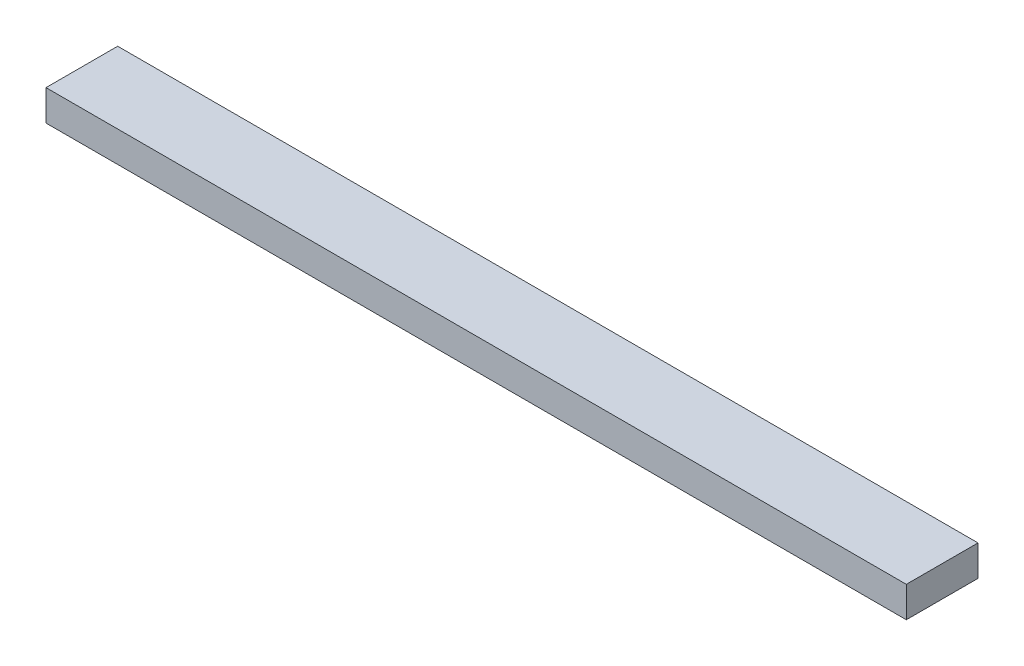
ISO-10303-21;
HEADER;
FILE_DESCRIPTION(('STEP AP214'),'2;1');
FILE_NAME('part.step','',(''),(''),'','','');
FILE_SCHEMA(('AUTOMOTIVE_DESIGN { 1 0 10303 214 1 1 1 1 }'));
ENDSEC;
DATA;
#1=APPLICATION_CONTEXT('core data for automotive mechanical design processes');
#2=APPLICATION_PROTOCOL_DEFINITION('international standard','automotive_design',2000,#1);
#3=PRODUCT_CONTEXT('',#1,'mechanical');
#4=PRODUCT('Part','Part','',(#3));
#5=PRODUCT_RELATED_PRODUCT_CATEGORY('part','',(#4));
#6=PRODUCT_DEFINITION_FORMATION('','',#4);
#7=PRODUCT_DEFINITION_CONTEXT('part definition',#1,'design');
#8=PRODUCT_DEFINITION('design','',#6,#7);
#9=PRODUCT_DEFINITION_SHAPE('','',#8);
#10=(LENGTH_UNIT() NAMED_UNIT(*) SI_UNIT(.MILLI.,.METRE.));
#11=(NAMED_UNIT(*) PLANE_ANGLE_UNIT() SI_UNIT($,.RADIAN.));
#12=(NAMED_UNIT(*) SI_UNIT($,.STERADIAN.) SOLID_ANGLE_UNIT());
#13=UNCERTAINTY_MEASURE_WITH_UNIT(LENGTH_MEASURE(1.E-05),#10,'distance_accuracy_value','');
#14=(GEOMETRIC_REPRESENTATION_CONTEXT(3) GLOBAL_UNCERTAINTY_ASSIGNED_CONTEXT((#13)) GLOBAL_UNIT_ASSIGNED_CONTEXT((#10,
#11,#12)) REPRESENTATION_CONTEXT('',''));
#15=CARTESIAN_POINT('',(0.,0.,0.));
#16=DIRECTION('',(0.,0.,1.));
#17=DIRECTION('',(1.,0.,0.));
#18=AXIS2_PLACEMENT_3D('',#15,#16,#17);
#19=CARTESIAN_POINT('',(0.,38.1,0.));
#20=DIRECTION('',(1.,0.,0.));
#21=DIRECTION('',(0.,0.,-1.));
#22=AXIS2_PLACEMENT_3D('',#19,#20,#21);
#23=PLANE('',#22);
#24=DIRECTION('',(0.,0.,1.));
#25=VECTOR('',#24,1.);
#26=CARTESIAN_POINT('',(0.,0.,0.));
#27=LINE('',#26,#25);
#28=CARTESIAN_POINT('',(0.,0.,-88.9));
#29=VERTEX_POINT('',#28);
#30=CARTESIAN_POINT('',(0.,0.,0.));
#31=VERTEX_POINT('',#30);
#32=EDGE_CURVE('E102',#29,#31,#27,.T.);
#33=ORIENTED_EDGE('',*,*,#32,.T.);
#34=DIRECTION('',(0.,-1.,0.));
#35=VECTOR('',#34,1.);
#36=CARTESIAN_POINT('',(0.,38.1,0.));
#37=LINE('',#36,#35);
#38=CARTESIAN_POINT('',(0.,38.1,0.));
#39=VERTEX_POINT('',#38);
#40=EDGE_CURVE('E11',#39,#31,#37,.T.);
#41=ORIENTED_EDGE('',*,*,#40,.F.);
#42=DIRECTION('',(0.,0.,1.));
#43=VECTOR('',#42,1.);
#44=CARTESIAN_POINT('',(0.,38.1,0.));
#45=LINE('',#44,#43);
#46=CARTESIAN_POINT('',(0.,38.1,-88.9));
#47=VERTEX_POINT('',#46);
#48=EDGE_CURVE('E90',#47,#39,#45,.T.);
#49=ORIENTED_EDGE('',*,*,#48,.F.);
#50=DIRECTION('',(0.,-1.,0.));
#51=VECTOR('',#50,1.);
#52=CARTESIAN_POINT('',(0.,38.1,-88.9));
#53=LINE('',#52,#51);
#54=EDGE_CURVE('E98',#47,#29,#53,.T.);
#55=ORIENTED_EDGE('',*,*,#54,.T.);
#56=EDGE_LOOP('',(#33,#41,#49,#55));
#57=FACE_BOUND('',#56,.T.);
#58=ADVANCED_FACE('F39',(#57),#23,.F.);
#59=CARTESIAN_POINT('',(0.,38.1,0.));
#60=DIRECTION('',(0.,0.,-1.));
#61=DIRECTION('',(-1.,0.,0.));
#62=AXIS2_PLACEMENT_3D('',#59,#60,#61);
#63=PLANE('',#62);
#64=DIRECTION('',(1.,0.,0.));
#65=VECTOR('',#64,1.);
#66=CARTESIAN_POINT('',(0.,0.,0.));
#67=LINE('',#66,#65);
#68=CARTESIAN_POINT('',(1066.8,0.,0.));
#69=VERTEX_POINT('',#68);
#70=EDGE_CURVE('E94',#31,#69,#67,.T.);
#71=ORIENTED_EDGE('',*,*,#70,.T.);
#72=DIRECTION('',(0.,-1.,0.));
#73=VECTOR('',#72,1.);
#74=CARTESIAN_POINT('',(1066.8,38.1,0.));
#75=LINE('',#74,#73);
#76=CARTESIAN_POINT('',(1066.8,38.1,0.));
#77=VERTEX_POINT('',#76);
#78=EDGE_CURVE('E47',#77,#69,#75,.T.);
#79=ORIENTED_EDGE('',*,*,#78,.F.);
#80=DIRECTION('',(1.,0.,0.));
#81=VECTOR('',#80,1.);
#82=CARTESIAN_POINT('',(0.,38.1,0.));
#83=LINE('',#82,#81);
#84=EDGE_CURVE('E85',#39,#77,#83,.T.);
#85=ORIENTED_EDGE('',*,*,#84,.F.);
#86=ORIENTED_EDGE('',*,*,#40,.T.);
#87=EDGE_LOOP('',(#71,#79,#85,#86));
#88=FACE_BOUND('',#87,.T.);
#89=ADVANCED_FACE('F93',(#88),#63,.F.);
#90=CARTESIAN_POINT('',(1066.8,38.1,0.));
#91=DIRECTION('',(-1.,0.,0.));
#92=DIRECTION('',(0.,0.,1.));
#93=AXIS2_PLACEMENT_3D('',#90,#91,#92);
#94=PLANE('',#93);
#95=DIRECTION('',(0.,0.,-1.));
#96=VECTOR('',#95,1.);
#97=CARTESIAN_POINT('',(1066.8,0.,0.));
#98=LINE('',#97,#96);
#99=CARTESIAN_POINT('',(1066.8,0.,-88.9));
#100=VERTEX_POINT('',#99);
#101=EDGE_CURVE('E72',#69,#100,#98,.T.);
#102=ORIENTED_EDGE('',*,*,#101,.T.);
#103=DIRECTION('',(0.,-1.,0.));
#104=VECTOR('',#103,1.);
#105=CARTESIAN_POINT('',(1066.8,38.1,-88.9));
#106=LINE('',#105,#104);
#107=CARTESIAN_POINT('',(1066.8,38.1,-88.9));
#108=VERTEX_POINT('',#107);
#109=EDGE_CURVE('E95',#108,#100,#106,.T.);
#110=ORIENTED_EDGE('',*,*,#109,.F.);
#111=DIRECTION('',(0.,0.,-1.));
#112=VECTOR('',#111,1.);
#113=CARTESIAN_POINT('',(1066.8,38.1,0.));
#114=LINE('',#113,#112);
#115=EDGE_CURVE('E88',#77,#108,#114,.T.);
#116=ORIENTED_EDGE('',*,*,#115,.F.);
#117=ORIENTED_EDGE('',*,*,#78,.T.);
#118=EDGE_LOOP('',(#102,#110,#116,#117));
#119=FACE_BOUND('',#118,.T.);
#120=ADVANCED_FACE('F96',(#119),#94,.F.);
#121=CARTESIAN_POINT('',(0.,38.1,-88.9));
#122=DIRECTION('',(0.,0.,1.));
#123=DIRECTION('',(1.,0.,0.));
#124=AXIS2_PLACEMENT_3D('',#121,#122,#123);
#125=PLANE('',#124);
#126=DIRECTION('',(-1.,0.,0.));
#127=VECTOR('',#126,1.);
#128=CARTESIAN_POINT('',(0.,0.,-88.9));
#129=LINE('',#128,#127);
#130=EDGE_CURVE('E78',#100,#29,#129,.T.);
#131=ORIENTED_EDGE('',*,*,#130,.T.);
#132=ORIENTED_EDGE('',*,*,#54,.F.);
#133=DIRECTION('',(-1.,0.,0.));
#134=VECTOR('',#133,1.);
#135=CARTESIAN_POINT('',(0.,38.1,-88.9));
#136=LINE('',#135,#134);
#137=EDGE_CURVE('E55',#108,#47,#136,.T.);
#138=ORIENTED_EDGE('',*,*,#137,.F.);
#139=ORIENTED_EDGE('',*,*,#109,.T.);
#140=EDGE_LOOP('',(#131,#132,#138,#139));
#141=FACE_BOUND('',#140,.T.);
#142=ADVANCED_FACE('F109',(#141),#125,.F.);
#143=CARTESIAN_POINT('',(0.,38.1,0.));
#144=DIRECTION('',(0.,-1.,0.));
#145=DIRECTION('',(0.,0.,-1.));
#146=AXIS2_PLACEMENT_3D('',#143,#144,#145);
#147=PLANE('',#146);
#148=ORIENTED_EDGE('',*,*,#48,.T.);
#149=ORIENTED_EDGE('',*,*,#84,.T.);
#150=ORIENTED_EDGE('',*,*,#115,.T.);
#151=ORIENTED_EDGE('',*,*,#137,.T.);
#152=EDGE_LOOP('',(#148,#149,#150,#151));
#153=FACE_BOUND('',#152,.T.);
#154=ADVANCED_FACE('F86',(#153),#147,.F.);
#155=CARTESIAN_POINT('',(0.,0.,0.));
#156=DIRECTION('',(0.,-1.,0.));
#157=DIRECTION('',(0.,0.,-1.));
#158=AXIS2_PLACEMENT_3D('',#155,#156,#157);
#159=PLANE('',#158);
#160=ORIENTED_EDGE('',*,*,#32,.F.);
#161=ORIENTED_EDGE('',*,*,#130,.F.);
#162=ORIENTED_EDGE('',*,*,#101,.F.);
#163=ORIENTED_EDGE('',*,*,#70,.F.);
#164=EDGE_LOOP('',(#160,#161,#162,#163));
#165=FACE_BOUND('',#164,.T.);
#166=ADVANCED_FACE('F112',(#165),#159,.T.);
#167=CLOSED_SHELL('',(#58,#89,#120,#142,#154,#166));
#168=MANIFOLD_SOLID_BREP('B2',#167);
#169=ADVANCED_BREP_SHAPE_REPRESENTATION('',(#18,#168),#14);
#170=SHAPE_DEFINITION_REPRESENTATION(#9,#169);
ENDSEC;
END-ISO-10303-21;
